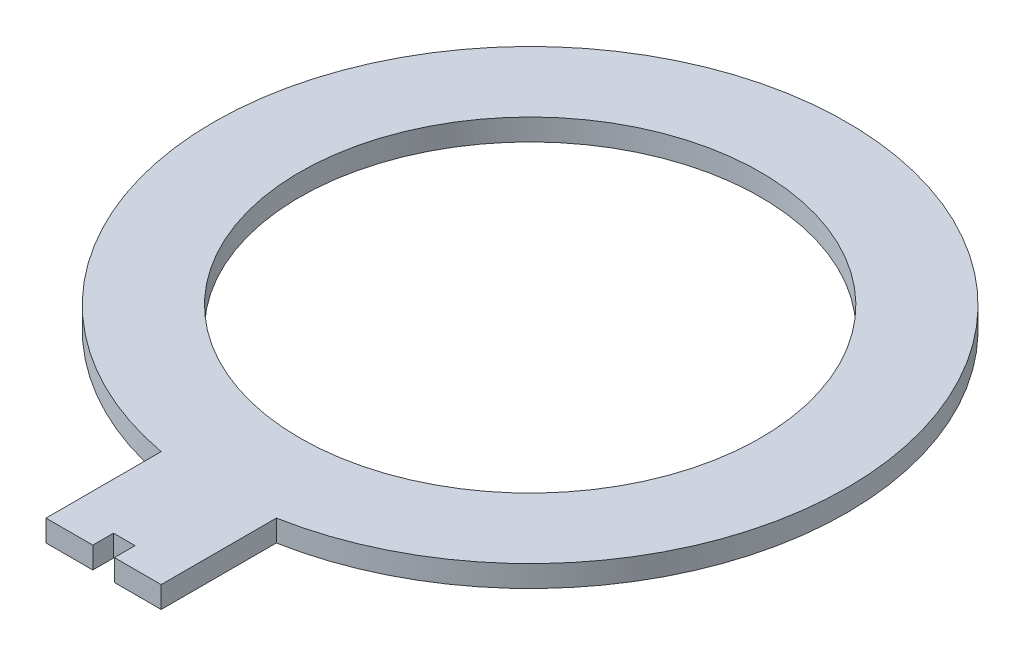
ISO-10303-21;
HEADER;
FILE_DESCRIPTION(('STEP AP214'),'2;1');
FILE_NAME('part.step','',(''),(''),'','','');
FILE_SCHEMA(('AUTOMOTIVE_DESIGN { 1 0 10303 214 1 1 1 1 }'));
ENDSEC;
DATA;
#1=APPLICATION_CONTEXT('core data for automotive mechanical design processes');
#2=APPLICATION_PROTOCOL_DEFINITION('international standard','automotive_design',2000,#1);
#3=PRODUCT_CONTEXT('',#1,'mechanical');
#4=PRODUCT('Part','Part','',(#3));
#5=PRODUCT_RELATED_PRODUCT_CATEGORY('part','',(#4));
#6=PRODUCT_DEFINITION_FORMATION('','',#4);
#7=PRODUCT_DEFINITION_CONTEXT('part definition',#1,'design');
#8=PRODUCT_DEFINITION('design','',#6,#7);
#9=PRODUCT_DEFINITION_SHAPE('','',#8);
#10=(LENGTH_UNIT() NAMED_UNIT(*) SI_UNIT(.MILLI.,.METRE.));
#11=(NAMED_UNIT(*) PLANE_ANGLE_UNIT() SI_UNIT($,.RADIAN.));
#12=(NAMED_UNIT(*) SI_UNIT($,.STERADIAN.) SOLID_ANGLE_UNIT());
#13=UNCERTAINTY_MEASURE_WITH_UNIT(LENGTH_MEASURE(1.E-05),#10,'distance_accuracy_value','');
#14=(GEOMETRIC_REPRESENTATION_CONTEXT(3) GLOBAL_UNCERTAINTY_ASSIGNED_CONTEXT((#13)) GLOBAL_UNIT_ASSIGNED_CONTEXT((#10,
#11,#12)) REPRESENTATION_CONTEXT('',''));
#15=CARTESIAN_POINT('',(0.,0.,0.));
#16=DIRECTION('',(0.,0.,1.));
#17=DIRECTION('',(1.,0.,0.));
#18=AXIS2_PLACEMENT_3D('',#15,#16,#17);
#19=CARTESIAN_POINT('',(12.7,4.7625,0.));
#20=DIRECTION('',(1.,0.,0.));
#21=DIRECTION('',(0.,0.,-1.));
#22=AXIS2_PLACEMENT_3D('',#19,#20,#21);
#23=PLANE('',#22);
#24=DIRECTION('',(0.,0.,1.));
#25=VECTOR('',#24,1.);
#26=CARTESIAN_POINT('',(12.7,0.,0.));
#27=LINE('',#26,#25);
#28=CARTESIAN_POINT('',(12.7,0.,68.685751797589));
#29=VERTEX_POINT('',#28);
#30=CARTESIAN_POINT('',(12.7,0.,94.085751797589));
#31=VERTEX_POINT('',#30);
#32=EDGE_CURVE('E145',#29,#31,#27,.T.);
#33=ORIENTED_EDGE('',*,*,#32,.F.);
#34=DIRECTION('',(0.,-1.,0.));
#35=VECTOR('',#34,1.);
#36=CARTESIAN_POINT('',(12.7,4.7625,68.685751797589));
#37=LINE('',#36,#35);
#38=CARTESIAN_POINT('',(12.7,4.7625,68.685751797589));
#39=VERTEX_POINT('',#38);
#40=EDGE_CURVE('E11',#39,#29,#37,.T.);
#41=ORIENTED_EDGE('',*,*,#40,.F.);
#42=DIRECTION('',(0.,0.,1.));
#43=VECTOR('',#42,1.);
#44=CARTESIAN_POINT('',(12.7,4.7625,0.));
#45=LINE('',#44,#43);
#46=CARTESIAN_POINT('',(12.7,4.7625,94.085751797589));
#47=VERTEX_POINT('',#46);
#48=EDGE_CURVE('E230',#39,#47,#45,.T.);
#49=ORIENTED_EDGE('',*,*,#48,.T.);
#50=DIRECTION('',(0.,-1.,0.));
#51=VECTOR('',#50,1.);
#52=CARTESIAN_POINT('',(12.7,4.7625,94.085751797589));
#53=LINE('',#52,#51);
#54=EDGE_CURVE('E93',#47,#31,#53,.T.);
#55=ORIENTED_EDGE('',*,*,#54,.T.);
#56=EDGE_LOOP('',(#33,#41,#49,#55));
#57=FACE_BOUND('',#56,.T.);
#58=ADVANCED_FACE('F41',(#57),#23,.T.);
#59=CARTESIAN_POINT('',(0.,4.7625,0.));
#60=DIRECTION('',(0.,-1.,0.));
#61=DIRECTION('',(0.,0.,-1.));
#62=AXIS2_PLACEMENT_3D('',#59,#60,#61);
#63=CYLINDRICAL_SURFACE('',#62,69.85);
#64=CARTESIAN_POINT('',(0.,0.,0.));
#65=DIRECTION('',(0.,1.,0.));
#66=DIRECTION('',(0.,0.,1.));
#67=AXIS2_PLACEMENT_3D('',#64,#65,#66);
#68=CIRCLE('',#67,69.85);
#69=CARTESIAN_POINT('',(-12.7,0.,68.685751797589));
#70=VERTEX_POINT('',#69);
#71=EDGE_CURVE('E149',#29,#70,#68,.T.);
#72=ORIENTED_EDGE('',*,*,#71,.T.);
#73=DIRECTION('',(0.,-1.,0.));
#74=VECTOR('',#73,1.);
#75=CARTESIAN_POINT('',(-12.7,4.7625,68.685751797589));
#76=LINE('',#75,#74);
#77=CARTESIAN_POINT('',(-12.7,4.7625,68.685751797589));
#78=VERTEX_POINT('',#77);
#79=EDGE_CURVE('E51',#78,#70,#76,.T.);
#80=ORIENTED_EDGE('',*,*,#79,.F.);
#81=CARTESIAN_POINT('',(0.,4.7625,0.));
#82=DIRECTION('',(0.,1.,0.));
#83=DIRECTION('',(0.,0.,1.));
#84=AXIS2_PLACEMENT_3D('',#81,#82,#83);
#85=CIRCLE('',#84,69.85);
#86=EDGE_CURVE('E234',#39,#78,#85,.T.);
#87=ORIENTED_EDGE('',*,*,#86,.F.);
#88=ORIENTED_EDGE('',*,*,#40,.T.);
#89=EDGE_LOOP('',(#72,#80,#87,#88));
#90=FACE_BOUND('',#89,.T.);
#91=ADVANCED_FACE('F195',(#90),#63,.T.);
#92=CARTESIAN_POINT('',(-12.7,4.7625,0.));
#93=DIRECTION('',(1.,0.,0.));
#94=DIRECTION('',(0.,0.,-1.));
#95=AXIS2_PLACEMENT_3D('',#92,#93,#94);
#96=PLANE('',#95);
#97=DIRECTION('',(0.,0.,1.));
#98=VECTOR('',#97,1.);
#99=CARTESIAN_POINT('',(-12.7,0.,0.));
#100=LINE('',#99,#98);
#101=CARTESIAN_POINT('',(-12.7,0.,94.085751797589));
#102=VERTEX_POINT('',#101);
#103=EDGE_CURVE('E153',#70,#102,#100,.T.);
#104=ORIENTED_EDGE('',*,*,#103,.T.);
#105=DIRECTION('',(0.,-1.,0.));
#106=VECTOR('',#105,1.);
#107=CARTESIAN_POINT('',(-12.7,4.7625,94.085751797589));
#108=LINE('',#107,#106);
#109=CARTESIAN_POINT('',(-12.7,4.7625,94.085751797589));
#110=VERTEX_POINT('',#109);
#111=EDGE_CURVE('E181',#110,#102,#108,.T.);
#112=ORIENTED_EDGE('',*,*,#111,.F.);
#113=DIRECTION('',(0.,0.,1.));
#114=VECTOR('',#113,1.);
#115=CARTESIAN_POINT('',(-12.7,4.7625,0.));
#116=LINE('',#115,#114);
#117=EDGE_CURVE('E191',#78,#110,#116,.T.);
#118=ORIENTED_EDGE('',*,*,#117,.F.);
#119=ORIENTED_EDGE('',*,*,#79,.T.);
#120=EDGE_LOOP('',(#104,#112,#118,#119));
#121=FACE_BOUND('',#120,.T.);
#122=ADVANCED_FACE('F188',(#121),#96,.F.);
#123=CARTESIAN_POINT('',(0.,4.7625,94.085751797589));
#124=DIRECTION('',(0.,0.,-1.));
#125=DIRECTION('',(-1.,0.,0.));
#126=AXIS2_PLACEMENT_3D('',#123,#124,#125);
#127=PLANE('',#126);
#128=DIRECTION('',(1.,0.,0.));
#129=VECTOR('',#128,1.);
#130=CARTESIAN_POINT('',(0.,0.,94.085751797589));
#131=LINE('',#130,#129);
#132=CARTESIAN_POINT('',(-2.38125000000001,0.,94.085751797589));
#133=VERTEX_POINT('',#132);
#134=EDGE_CURVE('E157',#102,#133,#131,.T.);
#135=ORIENTED_EDGE('',*,*,#134,.T.);
#136=DIRECTION('',(0.,-1.,0.));
#137=VECTOR('',#136,1.);
#138=CARTESIAN_POINT('',(-2.38125000000001,4.7625,94.085751797589));
#139=LINE('',#138,#137);
#140=CARTESIAN_POINT('',(-2.38125000000001,4.7625,94.085751797589));
#141=VERTEX_POINT('',#140);
#142=EDGE_CURVE('E177',#141,#133,#139,.T.);
#143=ORIENTED_EDGE('',*,*,#142,.F.);
#144=DIRECTION('',(1.,0.,0.));
#145=VECTOR('',#144,1.);
#146=CARTESIAN_POINT('',(0.,4.7625,94.085751797589));
#147=LINE('',#146,#145);
#148=EDGE_CURVE('E138',#110,#141,#147,.T.);
#149=ORIENTED_EDGE('',*,*,#148,.F.);
#150=ORIENTED_EDGE('',*,*,#111,.T.);
#151=EDGE_LOOP('',(#135,#143,#149,#150));
#152=FACE_BOUND('',#151,.T.);
#153=ADVANCED_FACE('F206',(#152),#127,.F.);
#154=CARTESIAN_POINT('',(-2.38125000000001,4.7625,0.));
#155=DIRECTION('',(-1.,0.,0.));
#156=DIRECTION('',(0.,0.,1.));
#157=AXIS2_PLACEMENT_3D('',#154,#155,#156);
#158=PLANE('',#157);
#159=DIRECTION('',(0.,0.,-1.));
#160=VECTOR('',#159,1.);
#161=CARTESIAN_POINT('',(-2.38125000000001,0.,0.));
#162=LINE('',#161,#160);
#163=CARTESIAN_POINT('',(-2.38125000000001,0.,89.521371797589));
#164=VERTEX_POINT('',#163);
#165=EDGE_CURVE('E161',#133,#164,#162,.T.);
#166=ORIENTED_EDGE('',*,*,#165,.T.);
#167=DIRECTION('',(0.,-1.,0.));
#168=VECTOR('',#167,1.);
#169=CARTESIAN_POINT('',(-2.38125000000001,4.7625,89.521371797589));
#170=LINE('',#169,#168);
#171=CARTESIAN_POINT('',(-2.38125000000001,4.7625,89.521371797589));
#172=VERTEX_POINT('',#171);
#173=EDGE_CURVE('E131',#172,#164,#170,.T.);
#174=ORIENTED_EDGE('',*,*,#173,.F.);
#175=DIRECTION('',(0.,0.,-1.));
#176=VECTOR('',#175,1.);
#177=CARTESIAN_POINT('',(-2.38125000000001,4.7625,0.));
#178=LINE('',#177,#176);
#179=EDGE_CURVE('E117',#141,#172,#178,.T.);
#180=ORIENTED_EDGE('',*,*,#179,.F.);
#181=ORIENTED_EDGE('',*,*,#142,.T.);
#182=EDGE_LOOP('',(#166,#174,#180,#181));
#183=FACE_BOUND('',#182,.T.);
#184=ADVANCED_FACE('F207',(#183),#158,.F.);
#185=CARTESIAN_POINT('',(0.,4.7625,89.521371797589));
#186=DIRECTION('',(0.,0.,-1.));
#187=DIRECTION('',(-1.,0.,0.));
#188=AXIS2_PLACEMENT_3D('',#185,#186,#187);
#189=PLANE('',#188);
#190=DIRECTION('',(1.,0.,0.));
#191=VECTOR('',#190,1.);
#192=CARTESIAN_POINT('',(0.,0.,89.521371797589));
#193=LINE('',#192,#191);
#194=CARTESIAN_POINT('',(2.38124999999999,0.,89.521371797589));
#195=VERTEX_POINT('',#194);
#196=EDGE_CURVE('E126',#164,#195,#193,.T.);
#197=ORIENTED_EDGE('',*,*,#196,.T.);
#198=DIRECTION('',(0.,-1.,0.));
#199=VECTOR('',#198,1.);
#200=CARTESIAN_POINT('',(2.38124999999999,4.7625,89.521371797589));
#201=LINE('',#200,#199);
#202=CARTESIAN_POINT('',(2.38124999999999,4.7625,89.521371797589));
#203=VERTEX_POINT('',#202);
#204=EDGE_CURVE('E124',#203,#195,#201,.T.);
#205=ORIENTED_EDGE('',*,*,#204,.F.);
#206=DIRECTION('',(1.,0.,0.));
#207=VECTOR('',#206,1.);
#208=CARTESIAN_POINT('',(0.,4.7625,89.521371797589));
#209=LINE('',#208,#207);
#210=EDGE_CURVE('E111',#172,#203,#209,.T.);
#211=ORIENTED_EDGE('',*,*,#210,.F.);
#212=ORIENTED_EDGE('',*,*,#173,.T.);
#213=EDGE_LOOP('',(#197,#205,#211,#212));
#214=FACE_BOUND('',#213,.T.);
#215=ADVANCED_FACE('F125',(#214),#189,.F.);
#216=CARTESIAN_POINT('',(2.38124999999999,4.7625,0.));
#217=DIRECTION('',(-1.,0.,0.));
#218=DIRECTION('',(0.,0.,1.));
#219=AXIS2_PLACEMENT_3D('',#216,#217,#218);
#220=PLANE('',#219);
#221=DIRECTION('',(0.,0.,-1.));
#222=VECTOR('',#221,1.);
#223=CARTESIAN_POINT('',(2.38124999999999,0.,0.));
#224=LINE('',#223,#222);
#225=CARTESIAN_POINT('',(2.38124999999999,0.,94.085751797589));
#226=VERTEX_POINT('',#225);
#227=EDGE_CURVE('E168',#226,#195,#224,.T.);
#228=ORIENTED_EDGE('',*,*,#227,.F.);
#229=DIRECTION('',(0.,-1.,0.));
#230=VECTOR('',#229,1.);
#231=CARTESIAN_POINT('',(2.38124999999999,4.7625,94.085751797589));
#232=LINE('',#231,#230);
#233=CARTESIAN_POINT('',(2.38124999999999,4.7625,94.085751797589));
#234=VERTEX_POINT('',#233);
#235=EDGE_CURVE('E86',#234,#226,#232,.T.);
#236=ORIENTED_EDGE('',*,*,#235,.F.);
#237=DIRECTION('',(0.,0.,-1.));
#238=VECTOR('',#237,1.);
#239=CARTESIAN_POINT('',(2.38124999999999,4.7625,0.));
#240=LINE('',#239,#238);
#241=EDGE_CURVE('E115',#234,#203,#240,.T.);
#242=ORIENTED_EDGE('',*,*,#241,.T.);
#243=ORIENTED_EDGE('',*,*,#204,.T.);
#244=EDGE_LOOP('',(#228,#236,#242,#243));
#245=FACE_BOUND('',#244,.T.);
#246=ADVANCED_FACE('F133',(#245),#220,.T.);
#247=CARTESIAN_POINT('',(0.,4.7625,0.));
#248=DIRECTION('',(0.,-1.,0.));
#249=DIRECTION('',(0.,0.,-1.));
#250=AXIS2_PLACEMENT_3D('',#247,#248,#249);
#251=CYLINDRICAL_SURFACE('',#250,50.8);
#252=CARTESIAN_POINT('',(0.,4.7625,0.));
#253=DIRECTION('',(0.,1.,0.));
#254=DIRECTION('',(0.,0.,1.));
#255=AXIS2_PLACEMENT_3D('',#252,#253,#254);
#256=CIRCLE('',#255,50.8);
#257=CARTESIAN_POINT('',(0.,4.7625,50.8));
#258=VERTEX_POINT('',#257);
#259=EDGE_CURVE('E227',#258,#258,#256,.T.);
#260=ORIENTED_EDGE('',*,*,#259,.T.);
#261=EDGE_LOOP('',(#260));
#262=FACE_BOUND('',#261,.T.);
#263=CARTESIAN_POINT('',(0.,0.,0.));
#264=DIRECTION('',(0.,1.,0.));
#265=DIRECTION('',(0.,0.,1.));
#266=AXIS2_PLACEMENT_3D('',#263,#264,#265);
#267=CIRCLE('',#266,50.8);
#268=CARTESIAN_POINT('',(0.,0.,50.8));
#269=VERTEX_POINT('',#268);
#270=EDGE_CURVE('E141',#269,#269,#267,.T.);
#271=ORIENTED_EDGE('',*,*,#270,.F.);
#272=EDGE_LOOP('',(#271));
#273=FACE_BOUND('',#272,.T.);
#274=ADVANCED_FACE('F43',(#262,#273),#251,.F.);
#275=EDGE_CURVE('E162',#226,#31,#131,.T.);
#276=ORIENTED_EDGE('',*,*,#275,.T.);
#277=ORIENTED_EDGE('',*,*,#54,.F.);
#278=EDGE_CURVE('E59',#234,#47,#147,.T.);
#279=ORIENTED_EDGE('',*,*,#278,.F.);
#280=ORIENTED_EDGE('',*,*,#235,.T.);
#281=EDGE_LOOP('',(#276,#277,#279,#280));
#282=FACE_BOUND('',#281,.T.);
#283=ADVANCED_FACE('F215',(#282),#127,.F.);
#284=CARTESIAN_POINT('',(0.,4.7625,0.));
#285=DIRECTION('',(0.,1.,0.));
#286=DIRECTION('',(0.,0.,1.));
#287=AXIS2_PLACEMENT_3D('',#284,#285,#286);
#288=PLANE('',#287);
#289=ORIENTED_EDGE('',*,*,#259,.F.);
#290=EDGE_LOOP('',(#289));
#291=FACE_BOUND('',#290,.T.);
#292=ORIENTED_EDGE('',*,*,#48,.F.);
#293=ORIENTED_EDGE('',*,*,#86,.T.);
#294=ORIENTED_EDGE('',*,*,#117,.T.);
#295=ORIENTED_EDGE('',*,*,#148,.T.);
#296=ORIENTED_EDGE('',*,*,#179,.T.);
#297=ORIENTED_EDGE('',*,*,#210,.T.);
#298=ORIENTED_EDGE('',*,*,#241,.F.);
#299=ORIENTED_EDGE('',*,*,#278,.T.);
#300=EDGE_LOOP('',(#292,#293,#294,#295,#296,#297,#298,#299));
#301=FACE_BOUND('',#300,.T.);
#302=ADVANCED_FACE('F113',(#291,#301),#288,.T.);
#303=CARTESIAN_POINT('',(0.,0.,0.));
#304=DIRECTION('',(0.,1.,0.));
#305=DIRECTION('',(0.,0.,1.));
#306=AXIS2_PLACEMENT_3D('',#303,#304,#305);
#307=PLANE('',#306);
#308=ORIENTED_EDGE('',*,*,#270,.T.);
#309=EDGE_LOOP('',(#308));
#310=FACE_BOUND('',#309,.T.);
#311=ORIENTED_EDGE('',*,*,#32,.T.);
#312=ORIENTED_EDGE('',*,*,#275,.F.);
#313=ORIENTED_EDGE('',*,*,#227,.T.);
#314=ORIENTED_EDGE('',*,*,#196,.F.);
#315=ORIENTED_EDGE('',*,*,#165,.F.);
#316=ORIENTED_EDGE('',*,*,#134,.F.);
#317=ORIENTED_EDGE('',*,*,#103,.F.);
#318=ORIENTED_EDGE('',*,*,#71,.F.);
#319=EDGE_LOOP('',(#311,#312,#313,#314,#315,#316,#317,#318));
#320=FACE_BOUND('',#319,.T.);
#321=ADVANCED_FACE('F197',(#310,#320),#307,.F.);
#322=CLOSED_SHELL('',(#58,#91,#122,#153,#184,#215,#246,#274,#283,#302,#321));
#323=MANIFOLD_SOLID_BREP('B2',#322);
#324=ADVANCED_BREP_SHAPE_REPRESENTATION('',(#18,#323),#14);
#325=SHAPE_DEFINITION_REPRESENTATION(#9,#324);
ENDSEC;
END-ISO-10303-21;
